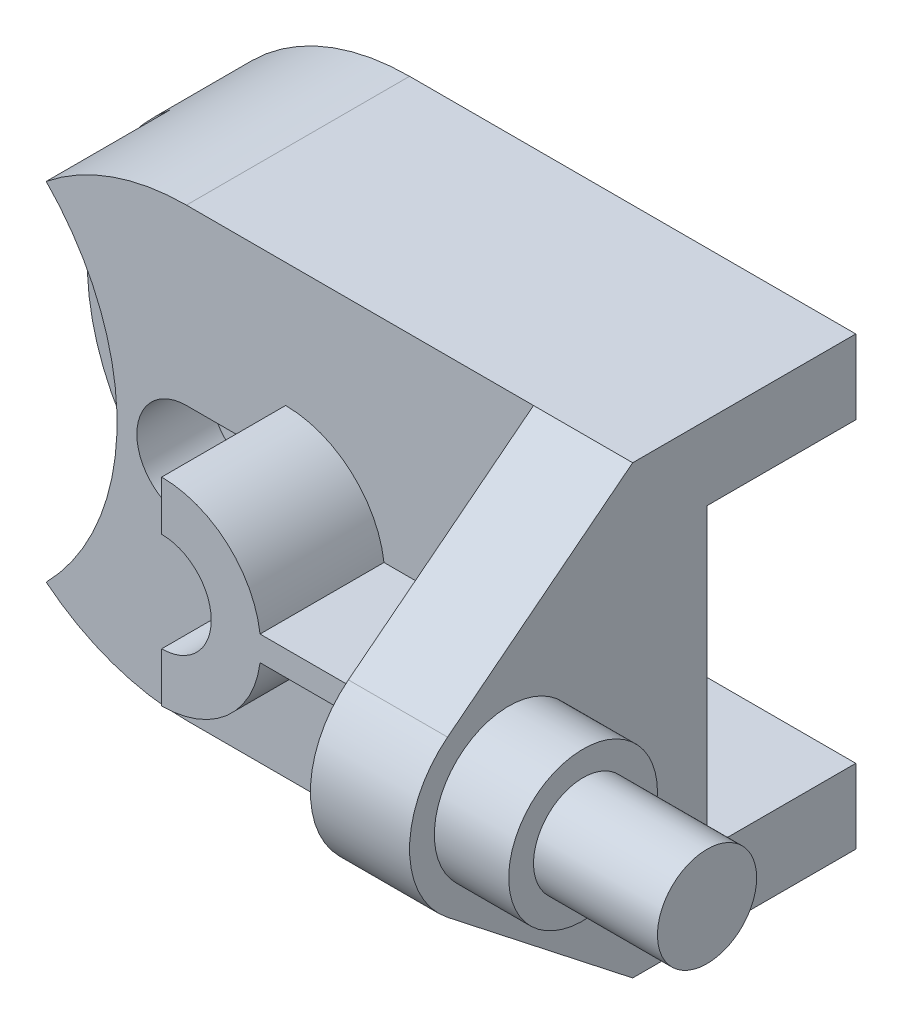
ISO-10303-21;
HEADER;
FILE_DESCRIPTION(('STEP AP214'),'2;1');
FILE_NAME('part.step','',(''),(''),'','','');
FILE_SCHEMA(('AUTOMOTIVE_DESIGN { 1 0 10303 214 1 1 1 1 }'));
ENDSEC;
DATA;
#1=APPLICATION_CONTEXT('core data for automotive mechanical design processes');
#2=APPLICATION_PROTOCOL_DEFINITION('international standard','automotive_design',2000,#1);
#3=PRODUCT_CONTEXT('',#1,'mechanical');
#4=PRODUCT('Part','Part','',(#3));
#5=PRODUCT_RELATED_PRODUCT_CATEGORY('part','',(#4));
#6=PRODUCT_DEFINITION_FORMATION('','',#4);
#7=PRODUCT_DEFINITION_CONTEXT('part definition',#1,'design');
#8=PRODUCT_DEFINITION('design','',#6,#7);
#9=PRODUCT_DEFINITION_SHAPE('','',#8);
#10=(LENGTH_UNIT() NAMED_UNIT(*) SI_UNIT(.MILLI.,.METRE.));
#11=(NAMED_UNIT(*) PLANE_ANGLE_UNIT() SI_UNIT($,.RADIAN.));
#12=(NAMED_UNIT(*) SI_UNIT($,.STERADIAN.) SOLID_ANGLE_UNIT());
#13=UNCERTAINTY_MEASURE_WITH_UNIT(LENGTH_MEASURE(1.E-05),#10,'distance_accuracy_value','');
#14=(GEOMETRIC_REPRESENTATION_CONTEXT(3) GLOBAL_UNCERTAINTY_ASSIGNED_CONTEXT((#13)) GLOBAL_UNIT_ASSIGNED_CONTEXT((#10,
#11,#12)) REPRESENTATION_CONTEXT('',''));
#15=CARTESIAN_POINT('',(0.,0.,0.));
#16=DIRECTION('',(0.,0.,1.));
#17=DIRECTION('',(1.,0.,0.));
#18=AXIS2_PLACEMENT_3D('',#15,#16,#17);
#19=CARTESIAN_POINT('',(-39.0000000000001,90.,45.));
#20=DIRECTION('',(0.,0.,-1.));
#21=DIRECTION('',(0.,1.,0.));
#22=AXIS2_PLACEMENT_3D('',#19,#20,#21);
#23=PLANE('',#22);
#24=DIRECTION('',(1.,0.,0.));
#25=VECTOR('',#24,1.);
#26=CARTESIAN_POINT('',(84.8431348329845,42.5,45.));
#27=LINE('',#26,#25);
#28=CARTESIAN_POINT('',(84.8431348329845,42.5,45.));
#29=VERTEX_POINT('',#28);
#30=CARTESIAN_POINT('',(115.,42.5,45.));
#31=VERTEX_POINT('',#30);
#32=EDGE_CURVE('E570',#29,#31,#27,.T.);
#33=ORIENTED_EDGE('',*,*,#32,.F.);
#34=CARTESIAN_POINT('',(65.,45.,45.));
#35=DIRECTION('',(0.,0.,1.));
#36=DIRECTION('',(-1.,0.,0.));
#37=AXIS2_PLACEMENT_3D('',#34,#35,#36);
#38=CIRCLE('',#37,20.);
#39=CARTESIAN_POINT('',(65.,24.9999999999999,45.));
#40=VERTEX_POINT('',#39);
#41=EDGE_CURVE('E273',#40,#29,#38,.T.);
#42=ORIENTED_EDGE('',*,*,#41,.F.);
#43=DIRECTION('',(0.,-1.,0.));
#44=VECTOR('',#43,1.);
#45=CARTESIAN_POINT('',(65.,35.,45.));
#46=LINE('',#45,#44);
#47=CARTESIAN_POINT('',(65.,35.,45.));
#48=VERTEX_POINT('',#47);
#49=EDGE_CURVE('E288',#48,#40,#46,.T.);
#50=ORIENTED_EDGE('',*,*,#49,.F.);
#51=DIRECTION('',(1.,0.,0.));
#52=VECTOR('',#51,1.);
#53=CARTESIAN_POINT('',(65.,35.,45.));
#54=LINE('',#53,#52);
#55=CARTESIAN_POINT('',(45.,35.,45.));
#56=VERTEX_POINT('',#55);
#57=EDGE_CURVE('E554',#56,#48,#54,.T.);
#58=ORIENTED_EDGE('',*,*,#57,.F.);
#59=CARTESIAN_POINT('',(45.,45.,45.));
#60=DIRECTION('',(0.,0.,1.));
#61=DIRECTION('',(1.,0.,0.));
#62=AXIS2_PLACEMENT_3D('',#59,#60,#61);
#63=CIRCLE('',#62,10.);
#64=CARTESIAN_POINT('',(45.,55.,45.));
#65=VERTEX_POINT('',#64);
#66=EDGE_CURVE('E551',#65,#56,#63,.T.);
#67=ORIENTED_EDGE('',*,*,#66,.F.);
#68=DIRECTION('',(-1.,0.,0.));
#69=VECTOR('',#68,1.);
#70=CARTESIAN_POINT('',(65.,55.,45.));
#71=LINE('',#70,#69);
#72=CARTESIAN_POINT('',(65.,55.,45.));
#73=VERTEX_POINT('',#72);
#74=EDGE_CURVE('E274',#73,#65,#71,.T.);
#75=ORIENTED_EDGE('',*,*,#74,.F.);
#76=DIRECTION('',(0.,-1.,0.));
#77=VECTOR('',#76,1.);
#78=CARTESIAN_POINT('',(65.,55.,45.));
#79=LINE('',#78,#77);
#80=CARTESIAN_POINT('',(65.,65.,45.));
#81=VERTEX_POINT('',#80);
#82=EDGE_CURVE('E294',#81,#73,#79,.T.);
#83=ORIENTED_EDGE('',*,*,#82,.F.);
#84=CARTESIAN_POINT('',(84.8431348329845,47.5,45.));
#85=VERTEX_POINT('',#84);
#86=EDGE_CURVE('E291',#85,#81,#38,.T.);
#87=ORIENTED_EDGE('',*,*,#86,.F.);
#88=DIRECTION('',(-1.,0.,0.));
#89=VECTOR('',#88,1.);
#90=CARTESIAN_POINT('',(84.8431348329845,47.5,45.));
#91=LINE('',#90,#89);
#92=CARTESIAN_POINT('',(115.,47.5,45.));
#93=VERTEX_POINT('',#92);
#94=EDGE_CURVE('E265',#93,#85,#91,.T.);
#95=ORIENTED_EDGE('',*,*,#94,.F.);
#96=DIRECTION('',(0.,1.,0.));
#97=VECTOR('',#96,1.);
#98=CARTESIAN_POINT('',(115.,90.,45.));
#99=LINE('',#98,#97);
#100=CARTESIAN_POINT('',(115.,90.,45.));
#101=VERTEX_POINT('',#100);
#102=EDGE_CURVE('E308',#93,#101,#99,.T.);
#103=ORIENTED_EDGE('',*,*,#102,.T.);
#104=DIRECTION('',(1.,0.,0.));
#105=VECTOR('',#104,1.);
#106=CARTESIAN_POINT('',(-39.0000000000001,90.,45.));
#107=LINE('',#106,#105);
#108=CARTESIAN_POINT('',(45.,90.,45.));
#109=VERTEX_POINT('',#108);
#110=EDGE_CURVE('E312',#109,#101,#107,.T.);
#111=ORIENTED_EDGE('',*,*,#110,.F.);
#112=CARTESIAN_POINT('',(45.,45.,45.));
#113=DIRECTION('',(0.,0.,-1.));
#114=DIRECTION('',(0.,1.,0.));
#115=AXIS2_PLACEMENT_3D('',#112,#113,#114);
#116=CIRCLE('',#115,45.);
#117=CARTESIAN_POINT('',(16.7157287525381,80.,45.));
#118=VERTEX_POINT('',#117);
#119=EDGE_CURVE('E324',#109,#118,#116,.F.);
#120=ORIENTED_EDGE('',*,*,#119,.T.);
#121=CARTESIAN_POINT('',(-18.9914133901762,45.,45.));
#122=DIRECTION('',(0.,0.,-1.));
#123=DIRECTION('',(0.,1.,0.));
#124=AXIS2_PLACEMENT_3D('',#121,#122,#123);
#125=CIRCLE('',#124,50.);
#126=CARTESIAN_POINT('',(16.7157287525381,10.,45.));
#127=VERTEX_POINT('',#126);
#128=EDGE_CURVE('E320',#118,#127,#125,.T.);
#129=ORIENTED_EDGE('',*,*,#128,.T.);
#130=CARTESIAN_POINT('',(45.,0.,45.));
#131=VERTEX_POINT('',#130);
#132=EDGE_CURVE('E322',#127,#131,#116,.F.);
#133=ORIENTED_EDGE('',*,*,#132,.T.);
#134=DIRECTION('',(-1.,0.,0.));
#135=VECTOR('',#134,1.);
#136=CARTESIAN_POINT('',(308.,0.,45.));
#137=LINE('',#136,#135);
#138=CARTESIAN_POINT('',(115.,0.,45.));
#139=VERTEX_POINT('',#138);
#140=EDGE_CURVE('E375',#139,#131,#137,.T.);
#141=ORIENTED_EDGE('',*,*,#140,.F.);
#142=EDGE_CURVE('E309',#139,#31,#99,.T.);
#143=ORIENTED_EDGE('',*,*,#142,.T.);
#144=EDGE_LOOP('',(#33,#42,#50,#58,#67,#75,#83,#87,#95,#103,#111,#120,#129,#133,#141,#143));
#145=FACE_BOUND('',#144,.T.);
#146=ADVANCED_FACE('F81',(#145),#23,.F.);
#147=CARTESIAN_POINT('',(115.,0.,0.));
#148=DIRECTION('',(-1.,0.,0.));
#149=DIRECTION('',(0.,0.,1.));
#150=AXIS2_PLACEMENT_3D('',#147,#148,#149);
#151=PLANE('',#150);
#152=DIRECTION('',(0.,1.,0.));
#153=VECTOR('',#152,1.);
#154=CARTESIAN_POINT('',(115.,47.5,70.));
#155=LINE('',#154,#153);
#156=CARTESIAN_POINT('',(115.,42.5,70.));
#157=VERTEX_POINT('',#156);
#158=CARTESIAN_POINT('',(115.,47.5,70.));
#159=VERTEX_POINT('',#158);
#160=EDGE_CURVE('E264',#157,#159,#155,.T.);
#161=ORIENTED_EDGE('',*,*,#160,.F.);
#162=DIRECTION('',(0.,0.,-1.));
#163=VECTOR('',#162,1.);
#164=CARTESIAN_POINT('',(115.,42.5,70.));
#165=LINE('',#164,#163);
#166=EDGE_CURVE('E260',#157,#31,#165,.T.);
#167=ORIENTED_EDGE('',*,*,#166,.T.);
#168=ORIENTED_EDGE('',*,*,#142,.F.);
#169=DIRECTION('',(0.,0.616806573816474,0.787114763231375));
#170=VECTOR('',#169,1.);
#171=CARTESIAN_POINT('',(115.,-21.8473902139099,17.1202657276448));
#172=LINE('',#171,#170);
#173=CARTESIAN_POINT('',(115.,29.2577047353725,82.3361314763295));
#174=VERTEX_POINT('',#173);
#175=EDGE_CURVE('E12',#139,#174,#172,.T.);
#176=ORIENTED_EDGE('',*,*,#175,.T.);
#177=CARTESIAN_POINT('',(115.,45.,70.));
#178=DIRECTION('',(-1.,0.,0.));
#179=DIRECTION('',(0.,0.,1.));
#180=AXIS2_PLACEMENT_3D('',#177,#178,#179);
#181=CIRCLE('',#180,20.);
#182=CARTESIAN_POINT('',(115.,60.7422952646275,82.3361314763295));
#183=VERTEX_POINT('',#182);
#184=EDGE_CURVE('E315',#174,#183,#181,.T.);
#185=ORIENTED_EDGE('',*,*,#184,.T.);
#186=DIRECTION('',(0.,0.616806573816474,-0.787114763231375));
#187=VECTOR('',#186,1.);
#188=CARTESIAN_POINT('',(115.,77.6068587586204,60.8150461554646));
#189=LINE('',#188,#187);
#190=EDGE_CURVE('E317',#183,#101,#189,.T.);
#191=ORIENTED_EDGE('',*,*,#190,.T.);
#192=ORIENTED_EDGE('',*,*,#102,.F.);
#193=DIRECTION('',(0.,0.,-1.));
#194=VECTOR('',#193,1.);
#195=CARTESIAN_POINT('',(115.,47.5,70.));
#196=LINE('',#195,#194);
#197=EDGE_CURVE('E578',#159,#93,#196,.T.);
#198=ORIENTED_EDGE('',*,*,#197,.F.);
#199=EDGE_LOOP('',(#161,#167,#168,#176,#185,#191,#192,#198));
#200=FACE_BOUND('',#199,.T.);
#201=ADVANCED_FACE('F478',(#200),#151,.T.);
#202=CARTESIAN_POINT('',(65.,45.,70.));
#203=DIRECTION('',(0.,0.,-1.));
#204=DIRECTION('',(-1.,0.,0.));
#205=AXIS2_PLACEMENT_3D('',#202,#203,#204);
#206=CYLINDRICAL_SURFACE('',#205,20.);
#207=DIRECTION('',(0.,0.,-1.));
#208=VECTOR('',#207,1.);
#209=CARTESIAN_POINT('',(84.8431348329845,42.5,70.));
#210=LINE('',#209,#208);
#211=CARTESIAN_POINT('',(84.8431348329845,42.5,70.));
#212=VERTEX_POINT('',#211);
#213=EDGE_CURVE('E257',#212,#29,#210,.T.);
#214=ORIENTED_EDGE('',*,*,#213,.F.);
#215=CARTESIAN_POINT('',(65.,45.,70.));
#216=DIRECTION('',(0.,0.,1.));
#217=DIRECTION('',(-1.,0.,0.));
#218=AXIS2_PLACEMENT_3D('',#215,#216,#217);
#219=CIRCLE('',#218,20.);
#220=CARTESIAN_POINT('',(65.,24.9999999999999,70.));
#221=VERTEX_POINT('',#220);
#222=EDGE_CURVE('E272',#221,#212,#219,.T.);
#223=ORIENTED_EDGE('',*,*,#222,.F.);
#224=DIRECTION('',(0.,0.,-1.));
#225=VECTOR('',#224,1.);
#226=CARTESIAN_POINT('',(65.,24.9999999999999,70.));
#227=LINE('',#226,#225);
#228=EDGE_CURVE('E303',#221,#40,#227,.T.);
#229=ORIENTED_EDGE('',*,*,#228,.T.);
#230=ORIENTED_EDGE('',*,*,#41,.T.);
#231=EDGE_LOOP('',(#214,#223,#229,#230));
#232=FACE_BOUND('',#231,.T.);
#233=ADVANCED_FACE('F270',(#232),#206,.T.);
#234=DIRECTION('',(0.,0.,-1.));
#235=VECTOR('',#234,1.);
#236=CARTESIAN_POINT('',(84.8431348329845,47.5,70.));
#237=LINE('',#236,#235);
#238=CARTESIAN_POINT('',(84.8431348329845,47.5,70.));
#239=VERTEX_POINT('',#238);
#240=EDGE_CURVE('E96',#239,#85,#237,.T.);
#241=ORIENTED_EDGE('',*,*,#240,.T.);
#242=ORIENTED_EDGE('',*,*,#86,.T.);
#243=DIRECTION('',(0.,0.,-1.));
#244=VECTOR('',#243,1.);
#245=CARTESIAN_POINT('',(65.,65.,70.));
#246=LINE('',#245,#244);
#247=CARTESIAN_POINT('',(65.,65.,70.));
#248=VERTEX_POINT('',#247);
#249=EDGE_CURVE('E300',#248,#81,#246,.T.);
#250=ORIENTED_EDGE('',*,*,#249,.F.);
#251=EDGE_CURVE('E281',#239,#248,#219,.T.);
#252=ORIENTED_EDGE('',*,*,#251,.F.);
#253=EDGE_LOOP('',(#241,#242,#250,#252));
#254=FACE_BOUND('',#253,.T.);
#255=ADVANCED_FACE('F593',(#254),#206,.T.);
#256=CARTESIAN_POINT('',(308.,45.,70.));
#257=DIRECTION('',(-1.,0.,0.));
#258=DIRECTION('',(0.,0.,1.));
#259=AXIS2_PLACEMENT_3D('',#256,#257,#258);
#260=CYLINDRICAL_SURFACE('',#259,20.);
#261=ORIENTED_EDGE('',*,*,#184,.F.);
#262=DIRECTION('',(-1.,0.,0.));
#263=VECTOR('',#262,1.);
#264=CARTESIAN_POINT('',(308.,29.2577047353725,82.3361314763295));
#265=LINE('',#264,#263);
#266=CARTESIAN_POINT('',(135.,29.2577047353725,82.3361314763295));
#267=VERTEX_POINT('',#266);
#268=EDGE_CURVE('E370',#267,#174,#265,.T.);
#269=ORIENTED_EDGE('',*,*,#268,.F.);
#270=CARTESIAN_POINT('',(135.,45.,70.));
#271=DIRECTION('',(-1.,0.,0.));
#272=DIRECTION('',(0.,0.,1.));
#273=AXIS2_PLACEMENT_3D('',#270,#271,#272);
#274=CIRCLE('',#273,20.);
#275=CARTESIAN_POINT('',(135.,60.7422952646275,82.3361314763295));
#276=VERTEX_POINT('',#275);
#277=EDGE_CURVE('E389',#276,#267,#274,.F.);
#278=ORIENTED_EDGE('',*,*,#277,.F.);
#279=DIRECTION('',(-1.,0.,0.));
#280=VECTOR('',#279,1.);
#281=CARTESIAN_POINT('',(308.,60.7422952646275,82.3361314763295));
#282=LINE('',#281,#280);
#283=EDGE_CURVE('E383',#276,#183,#282,.T.);
#284=ORIENTED_EDGE('',*,*,#283,.T.);
#285=EDGE_LOOP('',(#261,#269,#278,#284));
#286=FACE_BOUND('',#285,.T.);
#287=ADVANCED_FACE('F471',(#286),#260,.T.);
#288=CARTESIAN_POINT('',(308.,77.6068587586204,60.8150461554646));
#289=DIRECTION('',(0.,-0.787114763231375,-0.616806573816474));
#290=DIRECTION('',(0.,0.616806573816474,-0.787114763231375));
#291=AXIS2_PLACEMENT_3D('',#288,#289,#290);
#292=PLANE('',#291);
#293=ORIENTED_EDGE('',*,*,#190,.F.);
#294=ORIENTED_EDGE('',*,*,#283,.F.);
#295=DIRECTION('',(0.,-0.616806573816474,0.787114763231375));
#296=VECTOR('',#295,1.);
#297=CARTESIAN_POINT('',(135.,111.84739021391,17.1202657276448));
#298=LINE('',#297,#296);
#299=CARTESIAN_POINT('',(135.,90.,45.));
#300=VERTEX_POINT('',#299);
#301=EDGE_CURVE('E386',#300,#276,#298,.T.);
#302=ORIENTED_EDGE('',*,*,#301,.F.);
#303=DIRECTION('',(-1.,0.,0.));
#304=VECTOR('',#303,1.);
#305=CARTESIAN_POINT('',(308.,90.,45.));
#306=LINE('',#305,#304);
#307=EDGE_CURVE('E380',#300,#101,#306,.T.);
#308=ORIENTED_EDGE('',*,*,#307,.T.);
#309=EDGE_LOOP('',(#293,#294,#302,#308));
#310=FACE_BOUND('',#309,.T.);
#311=ADVANCED_FACE('F474',(#310),#292,.F.);
#312=CARTESIAN_POINT('',(308.,-21.8473902139099,17.1202657276448));
#313=DIRECTION('',(0.,0.787114763231375,-0.616806573816474));
#314=DIRECTION('',(0.,0.616806573816474,0.787114763231375));
#315=AXIS2_PLACEMENT_3D('',#312,#313,#314);
#316=PLANE('',#315);
#317=ORIENTED_EDGE('',*,*,#175,.F.);
#318=CARTESIAN_POINT('',(135.,0.,45.));
#319=VERTEX_POINT('',#318);
#320=EDGE_CURVE('E371',#319,#139,#137,.T.);
#321=ORIENTED_EDGE('',*,*,#320,.F.);
#322=DIRECTION('',(0.,-0.616806573816474,-0.787114763231375));
#323=VECTOR('',#322,1.);
#324=CARTESIAN_POINT('',(135.,-21.8473902139099,17.1202657276448));
#325=LINE('',#324,#323);
#326=EDGE_CURVE('E374',#267,#319,#325,.T.);
#327=ORIENTED_EDGE('',*,*,#326,.F.);
#328=ORIENTED_EDGE('',*,*,#268,.T.);
#329=EDGE_LOOP('',(#317,#321,#327,#328));
#330=FACE_BOUND('',#329,.T.);
#331=ADVANCED_FACE('F464',(#330),#316,.F.);
#332=CARTESIAN_POINT('',(150.,60.,0.));
#333=DIRECTION('',(-1.,0.,0.));
#334=DIRECTION('',(0.,0.,1.));
#335=AXIS2_PLACEMENT_3D('',#332,#333,#334);
#336=PLANE('',#335);
#337=CARTESIAN_POINT('',(150.,45.,70.));
#338=DIRECTION('',(1.,0.,0.));
#339=DIRECTION('',(0.,0.,-1.));
#340=AXIS2_PLACEMENT_3D('',#337,#338,#339);
#341=CIRCLE('',#340,10.);
#342=CARTESIAN_POINT('',(150.,45.,60.));
#343=VERTEX_POINT('',#342);
#344=EDGE_CURVE('E332',#343,#343,#341,.T.);
#345=ORIENTED_EDGE('',*,*,#344,.F.);
#346=EDGE_LOOP('',(#345));
#347=FACE_BOUND('',#346,.T.);
#348=CARTESIAN_POINT('',(150.,45.,70.));
#349=DIRECTION('',(1.,0.,0.));
#350=DIRECTION('',(0.,0.,-1.));
#351=AXIS2_PLACEMENT_3D('',#348,#349,#350);
#352=CIRCLE('',#351,15.);
#353=CARTESIAN_POINT('',(150.,45.,55.));
#354=VERTEX_POINT('',#353);
#355=EDGE_CURVE('E329',#354,#354,#352,.T.);
#356=ORIENTED_EDGE('',*,*,#355,.T.);
#357=EDGE_LOOP('',(#356));
#358=FACE_BOUND('',#357,.T.);
#359=ADVANCED_FACE('F719',(#347,#358),#336,.F.);
#360=CARTESIAN_POINT('',(175.,0.,90.));
#361=DIRECTION('',(-1.,0.,0.));
#362=DIRECTION('',(0.,0.,1.));
#363=AXIS2_PLACEMENT_3D('',#360,#361,#362);
#364=PLANE('',#363);
#365=CARTESIAN_POINT('',(175.,45.,70.));
#366=DIRECTION('',(1.,0.,0.));
#367=DIRECTION('',(0.,0.,-1.));
#368=AXIS2_PLACEMENT_3D('',#365,#366,#367);
#369=CIRCLE('',#368,10.);
#370=CARTESIAN_POINT('',(175.,45.,60.));
#371=VERTEX_POINT('',#370);
#372=EDGE_CURVE('E328',#371,#371,#369,.T.);
#373=ORIENTED_EDGE('',*,*,#372,.T.);
#374=EDGE_LOOP('',(#373));
#375=FACE_BOUND('',#374,.T.);
#376=ADVANCED_FACE('F727',(#375),#364,.F.);
#377=CARTESIAN_POINT('',(45.,45.,0.));
#378=DIRECTION('',(0.,0.,1.));
#379=DIRECTION('',(1.,0.,0.));
#380=AXIS2_PLACEMENT_3D('',#377,#378,#379);
#381=CYLINDRICAL_SURFACE('',#380,45.);
#382=ORIENTED_EDGE('',*,*,#119,.F.);
#383=DIRECTION('',(0.,0.,1.));
#384=VECTOR('',#383,1.);
#385=CARTESIAN_POINT('',(45.,90.,0.));
#386=LINE('',#385,#384);
#387=CARTESIAN_POINT('',(45.,90.,0.));
#388=VERTEX_POINT('',#387);
#389=EDGE_CURVE('E420',#388,#109,#386,.T.);
#390=ORIENTED_EDGE('',*,*,#389,.F.);
#391=CARTESIAN_POINT('',(45.,45.,0.));
#392=DIRECTION('',(0.,0.,1.));
#393=DIRECTION('',(1.,0.,0.));
#394=AXIS2_PLACEMENT_3D('',#391,#392,#393);
#395=CIRCLE('',#394,45.);
#396=CARTESIAN_POINT('',(45.,0.,0.));
#397=VERTEX_POINT('',#396);
#398=EDGE_CURVE('E418',#388,#397,#395,.T.);
#399=ORIENTED_EDGE('',*,*,#398,.T.);
#400=DIRECTION('',(0.,0.,1.));
#401=VECTOR('',#400,1.);
#402=CARTESIAN_POINT('',(45.,0.,0.));
#403=LINE('',#402,#401);
#404=EDGE_CURVE('E415',#397,#131,#403,.T.);
#405=ORIENTED_EDGE('',*,*,#404,.T.);
#406=ORIENTED_EDGE('',*,*,#132,.F.);
#407=DIRECTION('',(0.,0.,1.));
#408=VECTOR('',#407,1.);
#409=CARTESIAN_POINT('',(16.7157287525381,10.,20.));
#410=LINE('',#409,#408);
#411=CARTESIAN_POINT('',(16.7157287525381,10.,20.));
#412=VERTEX_POINT('',#411);
#413=EDGE_CURVE('E399',#412,#127,#410,.T.);
#414=ORIENTED_EDGE('',*,*,#413,.F.);
#415=CARTESIAN_POINT('',(45.,45.,20.));
#416=DIRECTION('',(0.,0.,1.));
#417=DIRECTION('',(1.,0.,0.));
#418=AXIS2_PLACEMENT_3D('',#415,#416,#417);
#419=CIRCLE('',#418,45.);
#420=CARTESIAN_POINT('',(16.7157287525381,80.,20.));
#421=VERTEX_POINT('',#420);
#422=EDGE_CURVE('E395',#421,#412,#419,.T.);
#423=ORIENTED_EDGE('',*,*,#422,.F.);
#424=DIRECTION('',(0.,0.,1.));
#425=VECTOR('',#424,1.);
#426=CARTESIAN_POINT('',(16.7157287525381,80.,20.));
#427=LINE('',#426,#425);
#428=EDGE_CURVE('E398',#421,#118,#427,.T.);
#429=ORIENTED_EDGE('',*,*,#428,.T.);
#430=EDGE_LOOP('',(#382,#390,#399,#405,#406,#414,#423,#429));
#431=FACE_BOUND('',#430,.T.);
#432=ADVANCED_FACE('F453',(#431),#381,.T.);
#433=CARTESIAN_POINT('',(0.,0.,0.));
#434=DIRECTION('',(0.,0.,-1.));
#435=DIRECTION('',(-1.,0.,0.));
#436=AXIS2_PLACEMENT_3D('',#433,#434,#435);
#437=PLANE('',#436);
#438=DIRECTION('',(1.,0.,0.));
#439=VECTOR('',#438,1.);
#440=CARTESIAN_POINT('',(135.,75.,0.));
#441=LINE('',#440,#439);
#442=CARTESIAN_POINT('',(45.,75.,0.));
#443=VERTEX_POINT('',#442);
#444=CARTESIAN_POINT('',(135.,75.,0.));
#445=VERTEX_POINT('',#444);
#446=EDGE_CURVE('E341',#443,#445,#441,.T.);
#447=ORIENTED_EDGE('',*,*,#446,.F.);
#448=CARTESIAN_POINT('',(45.,45.,0.));
#449=DIRECTION('',(0.,0.,-1.));
#450=DIRECTION('',(1.,0.,0.));
#451=AXIS2_PLACEMENT_3D('',#448,#449,#450);
#452=CIRCLE('',#451,30.);
#453=CARTESIAN_POINT('',(45.,15.,0.));
#454=VERTEX_POINT('',#453);
#455=EDGE_CURVE('E354',#454,#443,#452,.T.);
#456=ORIENTED_EDGE('',*,*,#455,.F.);
#457=DIRECTION('',(-1.,0.,0.));
#458=VECTOR('',#457,1.);
#459=CARTESIAN_POINT('',(135.,15.,0.));
#460=LINE('',#459,#458);
#461=CARTESIAN_POINT('',(135.,15.,0.));
#462=VERTEX_POINT('',#461);
#463=EDGE_CURVE('E335',#462,#454,#460,.T.);
#464=ORIENTED_EDGE('',*,*,#463,.F.);
#465=DIRECTION('',(0.,-1.,0.));
#466=VECTOR('',#465,1.);
#467=CARTESIAN_POINT('',(135.,0.,0.));
#468=LINE('',#467,#466);
#469=CARTESIAN_POINT('',(135.,0.,0.));
#470=VERTEX_POINT('',#469);
#471=EDGE_CURVE('E402',#462,#470,#468,.T.);
#472=ORIENTED_EDGE('',*,*,#471,.T.);
#473=DIRECTION('',(1.,0.,0.));
#474=VECTOR('',#473,1.);
#475=CARTESIAN_POINT('',(0.,0.,0.));
#476=LINE('',#475,#474);
#477=EDGE_CURVE('E423',#397,#470,#476,.T.);
#478=ORIENTED_EDGE('',*,*,#477,.F.);
#479=ORIENTED_EDGE('',*,*,#398,.F.);
#480=DIRECTION('',(-1.,0.,0.));
#481=VECTOR('',#480,1.);
#482=CARTESIAN_POINT('',(0.,90.,0.));
#483=LINE('',#482,#481);
#484=CARTESIAN_POINT('',(135.,90.,0.));
#485=VERTEX_POINT('',#484);
#486=EDGE_CURVE('E426',#485,#388,#483,.T.);
#487=ORIENTED_EDGE('',*,*,#486,.F.);
#488=DIRECTION('',(0.,-1.,0.));
#489=VECTOR('',#488,1.);
#490=CARTESIAN_POINT('',(135.,90.,0.));
#491=LINE('',#490,#489);
#492=EDGE_CURVE('E409',#485,#445,#491,.T.);
#493=ORIENTED_EDGE('',*,*,#492,.T.);
#494=EDGE_LOOP('',(#447,#456,#464,#472,#478,#479,#487,#493));
#495=FACE_BOUND('',#494,.T.);
#496=ADVANCED_FACE('F489',(#495),#437,.T.);
#497=CARTESIAN_POINT('',(0.,0.,90.));
#498=DIRECTION('',(0.,1.,0.));
#499=DIRECTION('',(0.,0.,1.));
#500=AXIS2_PLACEMENT_3D('',#497,#498,#499);
#501=PLANE('',#500);
#502=DIRECTION('',(0.,0.,1.));
#503=VECTOR('',#502,1.);
#504=CARTESIAN_POINT('',(135.,0.,0.));
#505=LINE('',#504,#503);
#506=EDGE_CURVE('E406',#470,#319,#505,.T.);
#507=ORIENTED_EDGE('',*,*,#506,.T.);
#508=ORIENTED_EDGE('',*,*,#320,.T.);
#509=ORIENTED_EDGE('',*,*,#140,.T.);
#510=ORIENTED_EDGE('',*,*,#404,.F.);
#511=ORIENTED_EDGE('',*,*,#477,.T.);
#512=EDGE_LOOP('',(#507,#508,#509,#510,#511));
#513=FACE_BOUND('',#512,.T.);
#514=ADVANCED_FACE('F83',(#513),#501,.F.);
#515=CARTESIAN_POINT('',(0.,90.,90.));
#516=DIRECTION('',(0.,-1.,0.));
#517=DIRECTION('',(0.,0.,-1.));
#518=AXIS2_PLACEMENT_3D('',#515,#516,#517);
#519=PLANE('',#518);
#520=ORIENTED_EDGE('',*,*,#389,.T.);
#521=ORIENTED_EDGE('',*,*,#110,.T.);
#522=ORIENTED_EDGE('',*,*,#307,.F.);
#523=DIRECTION('',(0.,0.,1.));
#524=VECTOR('',#523,1.);
#525=CARTESIAN_POINT('',(135.,90.,0.));
#526=LINE('',#525,#524);
#527=EDGE_CURVE('E412',#485,#300,#526,.T.);
#528=ORIENTED_EDGE('',*,*,#527,.F.);
#529=ORIENTED_EDGE('',*,*,#486,.T.);
#530=EDGE_LOOP('',(#520,#521,#522,#528,#529));
#531=FACE_BOUND('',#530,.T.);
#532=ADVANCED_FACE('F481',(#531),#519,.F.);
#533=CARTESIAN_POINT('',(135.,90.,0.));
#534=DIRECTION('',(-1.,0.,0.));
#535=DIRECTION('',(0.,0.,1.));
#536=AXIS2_PLACEMENT_3D('',#533,#534,#535);
#537=PLANE('',#536);
#538=CARTESIAN_POINT('',(135.,45.,70.));
#539=DIRECTION('',(1.,0.,0.));
#540=DIRECTION('',(0.,0.,-1.));
#541=AXIS2_PLACEMENT_3D('',#538,#539,#540);
#542=CIRCLE('',#541,15.);
#543=CARTESIAN_POINT('',(135.,45.,55.));
#544=VERTEX_POINT('',#543);
#545=EDGE_CURVE('E325',#544,#544,#542,.T.);
#546=ORIENTED_EDGE('',*,*,#545,.F.);
#547=EDGE_LOOP('',(#546));
#548=FACE_BOUND('',#547,.T.);
#549=DIRECTION('',(0.,-1.,0.));
#550=VECTOR('',#549,1.);
#551=CARTESIAN_POINT('',(135.,75.,30.));
#552=LINE('',#551,#550);
#553=CARTESIAN_POINT('',(135.,75.,30.));
#554=VERTEX_POINT('',#553);
#555=CARTESIAN_POINT('',(135.,15.,30.));
#556=VERTEX_POINT('',#555);
#557=EDGE_CURVE('E338',#554,#556,#552,.T.);
#558=ORIENTED_EDGE('',*,*,#557,.F.);
#559=DIRECTION('',(0.,0.,-1.));
#560=VECTOR('',#559,1.);
#561=CARTESIAN_POINT('',(135.,75.,30.));
#562=LINE('',#561,#560);
#563=EDGE_CURVE('E358',#554,#445,#562,.T.);
#564=ORIENTED_EDGE('',*,*,#563,.T.);
#565=ORIENTED_EDGE('',*,*,#492,.F.);
#566=ORIENTED_EDGE('',*,*,#527,.T.);
#567=ORIENTED_EDGE('',*,*,#301,.T.);
#568=ORIENTED_EDGE('',*,*,#277,.T.);
#569=ORIENTED_EDGE('',*,*,#326,.T.);
#570=ORIENTED_EDGE('',*,*,#506,.F.);
#571=ORIENTED_EDGE('',*,*,#471,.F.);
#572=DIRECTION('',(0.,0.,-1.));
#573=VECTOR('',#572,1.);
#574=CARTESIAN_POINT('',(135.,15.,30.));
#575=LINE('',#574,#573);
#576=EDGE_CURVE('E351',#556,#462,#575,.T.);
#577=ORIENTED_EDGE('',*,*,#576,.F.);
#578=EDGE_LOOP('',(#558,#564,#565,#566,#567,#568,#569,#570,#571,#577));
#579=FACE_BOUND('',#578,.T.);
#580=ADVANCED_FACE('F467',(#548,#579),#537,.F.);
#581=CARTESIAN_POINT('',(-18.9914133901762,45.,20.));
#582=DIRECTION('',(0.,0.,1.));
#583=DIRECTION('',(1.,0.,0.));
#584=AXIS2_PLACEMENT_3D('',#581,#582,#583);
#585=CYLINDRICAL_SURFACE('',#584,50.);
#586=ORIENTED_EDGE('',*,*,#128,.F.);
#587=ORIENTED_EDGE('',*,*,#428,.F.);
#588=CARTESIAN_POINT('',(-18.9914133901762,45.,20.));
#589=DIRECTION('',(0.,0.,1.));
#590=DIRECTION('',(1.,0.,0.));
#591=AXIS2_PLACEMENT_3D('',#588,#589,#590);
#592=CIRCLE('',#591,50.);
#593=CARTESIAN_POINT('',(25.505970602179,67.803131755022,20.));
#594=VERTEX_POINT('',#593);
#595=EDGE_CURVE('E392',#421,#594,#592,.F.);
#596=ORIENTED_EDGE('',*,*,#595,.T.);
#597=DIRECTION('',(0.,0.,-1.));
#598=VECTOR('',#597,1.);
#599=CARTESIAN_POINT('',(25.505970602179,67.803131755022,15.));
#600=LINE('',#599,#598);
#601=CARTESIAN_POINT('',(25.505970602179,67.803131755022,30.));
#602=VERTEX_POINT('',#601);
#603=EDGE_CURVE('E368',#602,#594,#600,.T.);
#604=ORIENTED_EDGE('',*,*,#603,.F.);
#605=CARTESIAN_POINT('',(-18.9914133901762,45.,30.));
#606=DIRECTION('',(0.,0.,1.));
#607=DIRECTION('',(1.,0.,0.));
#608=AXIS2_PLACEMENT_3D('',#605,#606,#607);
#609=CIRCLE('',#608,50.);
#610=CARTESIAN_POINT('',(25.505970602179,22.196868244978,30.));
#611=VERTEX_POINT('',#610);
#612=EDGE_CURVE('E89',#611,#602,#609,.T.);
#613=ORIENTED_EDGE('',*,*,#612,.F.);
#614=DIRECTION('',(0.,0.,-1.));
#615=VECTOR('',#614,1.);
#616=CARTESIAN_POINT('',(25.505970602179,22.196868244978,15.));
#617=LINE('',#616,#615);
#618=CARTESIAN_POINT('',(25.505970602179,22.196868244978,20.));
#619=VERTEX_POINT('',#618);
#620=EDGE_CURVE('E361',#619,#611,#617,.F.);
#621=ORIENTED_EDGE('',*,*,#620,.F.);
#622=EDGE_CURVE('E391',#619,#412,#592,.F.);
#623=ORIENTED_EDGE('',*,*,#622,.T.);
#624=ORIENTED_EDGE('',*,*,#413,.T.);
#625=EDGE_LOOP('',(#586,#587,#596,#604,#613,#621,#623,#624));
#626=FACE_BOUND('',#625,.T.);
#627=ADVANCED_FACE('F443',(#626),#585,.F.);
#628=CARTESIAN_POINT('',(0.,0.,20.));
#629=DIRECTION('',(0.,0.,1.));
#630=DIRECTION('',(1.,0.,0.));
#631=AXIS2_PLACEMENT_3D('',#628,#629,#630);
#632=PLANE('',#631);
#633=CARTESIAN_POINT('',(45.,45.,20.));
#634=DIRECTION('',(0.,0.,1.));
#635=DIRECTION('',(1.,0.,0.));
#636=AXIS2_PLACEMENT_3D('',#633,#634,#635);
#637=CIRCLE('',#636,30.);
#638=EDGE_CURVE('E428',#594,#619,#637,.T.);
#639=ORIENTED_EDGE('',*,*,#638,.F.);
#640=ORIENTED_EDGE('',*,*,#595,.F.);
#641=ORIENTED_EDGE('',*,*,#422,.T.);
#642=ORIENTED_EDGE('',*,*,#622,.F.);
#643=EDGE_LOOP('',(#639,#640,#641,#642));
#644=FACE_BOUND('',#643,.T.);
#645=ADVANCED_FACE('F447',(#644),#632,.T.);
#646=CARTESIAN_POINT('',(135.,75.,30.));
#647=DIRECTION('',(0.,1.,0.));
#648=DIRECTION('',(0.,0.,1.));
#649=AXIS2_PLACEMENT_3D('',#646,#647,#648);
#650=PLANE('',#649);
#651=ORIENTED_EDGE('',*,*,#446,.T.);
#652=ORIENTED_EDGE('',*,*,#563,.F.);
#653=DIRECTION('',(1.,0.,0.));
#654=VECTOR('',#653,1.);
#655=CARTESIAN_POINT('',(135.,75.,30.));
#656=LINE('',#655,#654);
#657=CARTESIAN_POINT('',(45.,75.,30.));
#658=VERTEX_POINT('',#657);
#659=EDGE_CURVE('E348',#658,#554,#656,.T.);
#660=ORIENTED_EDGE('',*,*,#659,.F.);
#661=DIRECTION('',(0.,0.,-1.));
#662=VECTOR('',#661,1.);
#663=CARTESIAN_POINT('',(45.,75.,30.));
#664=LINE('',#663,#662);
#665=EDGE_CURVE('E362',#658,#443,#664,.T.);
#666=ORIENTED_EDGE('',*,*,#665,.T.);
#667=EDGE_LOOP('',(#651,#652,#660,#666));
#668=FACE_BOUND('',#667,.T.);
#669=ADVANCED_FACE('F498',(#668),#650,.F.);
#670=CARTESIAN_POINT('',(45.,45.,30.));
#671=DIRECTION('',(0.,0.,-1.));
#672=DIRECTION('',(-1.,0.,0.));
#673=AXIS2_PLACEMENT_3D('',#670,#671,#672);
#674=CYLINDRICAL_SURFACE('',#673,30.);
#675=ORIENTED_EDGE('',*,*,#603,.T.);
#676=ORIENTED_EDGE('',*,*,#638,.T.);
#677=ORIENTED_EDGE('',*,*,#620,.T.);
#678=CARTESIAN_POINT('',(45.,45.,30.));
#679=DIRECTION('',(0.,0.,-1.));
#680=DIRECTION('',(1.,0.,0.));
#681=AXIS2_PLACEMENT_3D('',#678,#679,#680);
#682=CIRCLE('',#681,30.);
#683=CARTESIAN_POINT('',(45.,15.,30.));
#684=VERTEX_POINT('',#683);
#685=EDGE_CURVE('E345',#684,#611,#682,.T.);
#686=ORIENTED_EDGE('',*,*,#685,.F.);
#687=DIRECTION('',(0.,0.,-1.));
#688=VECTOR('',#687,1.);
#689=CARTESIAN_POINT('',(45.,15.,30.));
#690=LINE('',#689,#688);
#691=EDGE_CURVE('E364',#684,#454,#690,.T.);
#692=ORIENTED_EDGE('',*,*,#691,.T.);
#693=ORIENTED_EDGE('',*,*,#455,.T.);
#694=ORIENTED_EDGE('',*,*,#665,.F.);
#695=EDGE_CURVE('E344',#602,#658,#682,.T.);
#696=ORIENTED_EDGE('',*,*,#695,.F.);
#697=EDGE_LOOP('',(#675,#676,#677,#686,#692,#693,#694,#696));
#698=FACE_BOUND('',#697,.T.);
#699=ADVANCED_FACE('F439',(#698),#674,.F.);
#700=CARTESIAN_POINT('',(135.,15.,30.));
#701=DIRECTION('',(0.,-1.,0.));
#702=DIRECTION('',(0.,0.,-1.));
#703=AXIS2_PLACEMENT_3D('',#700,#701,#702);
#704=PLANE('',#703);
#705=ORIENTED_EDGE('',*,*,#463,.T.);
#706=ORIENTED_EDGE('',*,*,#691,.F.);
#707=DIRECTION('',(-1.,0.,0.));
#708=VECTOR('',#707,1.);
#709=CARTESIAN_POINT('',(135.,15.,30.));
#710=LINE('',#709,#708);
#711=EDGE_CURVE('E340',#556,#684,#710,.T.);
#712=ORIENTED_EDGE('',*,*,#711,.F.);
#713=ORIENTED_EDGE('',*,*,#576,.T.);
#714=EDGE_LOOP('',(#705,#706,#712,#713));
#715=FACE_BOUND('',#714,.T.);
#716=ADVANCED_FACE('F496',(#715),#704,.F.);
#717=CARTESIAN_POINT('',(45.,45.,30.));
#718=DIRECTION('',(0.,0.,1.));
#719=DIRECTION('',(1.,0.,0.));
#720=AXIS2_PLACEMENT_3D('',#717,#718,#719);
#721=PLANE('',#720);
#722=DIRECTION('',(1.,0.,0.));
#723=VECTOR('',#722,1.);
#724=CARTESIAN_POINT('',(65.,35.,30.));
#725=LINE('',#724,#723);
#726=CARTESIAN_POINT('',(45.,35.,30.));
#727=VERTEX_POINT('',#726);
#728=CARTESIAN_POINT('',(65.,35.,30.));
#729=VERTEX_POINT('',#728);
#730=EDGE_CURVE('E536',#727,#729,#725,.T.);
#731=ORIENTED_EDGE('',*,*,#730,.T.);
#732=CARTESIAN_POINT('',(65.,45.,30.));
#733=DIRECTION('',(0.,0.,1.));
#734=DIRECTION('',(1.,0.,0.));
#735=AXIS2_PLACEMENT_3D('',#732,#733,#734);
#736=CIRCLE('',#735,10.);
#737=CARTESIAN_POINT('',(65.,55.,30.));
#738=VERTEX_POINT('',#737);
#739=EDGE_CURVE('E539',#729,#738,#736,.T.);
#740=ORIENTED_EDGE('',*,*,#739,.T.);
#741=DIRECTION('',(-1.,0.,0.));
#742=VECTOR('',#741,1.);
#743=CARTESIAN_POINT('',(65.,55.,30.));
#744=LINE('',#743,#742);
#745=CARTESIAN_POINT('',(45.,55.,30.));
#746=VERTEX_POINT('',#745);
#747=EDGE_CURVE('E545',#738,#746,#744,.T.);
#748=ORIENTED_EDGE('',*,*,#747,.T.);
#749=CARTESIAN_POINT('',(45.,45.,30.));
#750=DIRECTION('',(0.,0.,1.));
#751=DIRECTION('',(1.,0.,0.));
#752=AXIS2_PLACEMENT_3D('',#749,#750,#751);
#753=CIRCLE('',#752,10.);
#754=EDGE_CURVE('E104',#746,#727,#753,.T.);
#755=ORIENTED_EDGE('',*,*,#754,.T.);
#756=EDGE_LOOP('',(#731,#740,#748,#755));
#757=FACE_BOUND('',#756,.T.);
#758=ORIENTED_EDGE('',*,*,#612,.T.);
#759=ORIENTED_EDGE('',*,*,#695,.T.);
#760=ORIENTED_EDGE('',*,*,#659,.T.);
#761=ORIENTED_EDGE('',*,*,#557,.T.);
#762=ORIENTED_EDGE('',*,*,#711,.T.);
#763=ORIENTED_EDGE('',*,*,#685,.T.);
#764=EDGE_LOOP('',(#758,#759,#760,#761,#762,#763));
#765=FACE_BOUND('',#764,.T.);
#766=ADVANCED_FACE('F432',(#757,#765),#721,.F.);
#767=CARTESIAN_POINT('',(150.,45.,70.));
#768=DIRECTION('',(1.,0.,0.));
#769=DIRECTION('',(0.,0.,-1.));
#770=AXIS2_PLACEMENT_3D('',#767,#768,#769);
#771=CYLINDRICAL_SURFACE('',#770,10.);
#772=ORIENTED_EDGE('',*,*,#372,.F.);
#773=EDGE_LOOP('',(#772));
#774=FACE_BOUND('',#773,.T.);
#775=ORIENTED_EDGE('',*,*,#344,.T.);
#776=EDGE_LOOP('',(#775));
#777=FACE_BOUND('',#776,.T.);
#778=ADVANCED_FACE('F521',(#774,#777),#771,.T.);
#779=CARTESIAN_POINT('',(135.,45.,70.));
#780=DIRECTION('',(1.,0.,0.));
#781=DIRECTION('',(0.,0.,-1.));
#782=AXIS2_PLACEMENT_3D('',#779,#780,#781);
#783=CYLINDRICAL_SURFACE('',#782,15.);
#784=ORIENTED_EDGE('',*,*,#355,.F.);
#785=EDGE_LOOP('',(#784));
#786=FACE_BOUND('',#785,.T.);
#787=ORIENTED_EDGE('',*,*,#545,.T.);
#788=EDGE_LOOP('',(#787));
#789=FACE_BOUND('',#788,.T.);
#790=ADVANCED_FACE('F517',(#786,#789),#783,.T.);
#791=CARTESIAN_POINT('',(65.,45.,70.));
#792=DIRECTION('',(0.,0.,-1.));
#793=DIRECTION('',(-1.,0.,0.));
#794=AXIS2_PLACEMENT_3D('',#791,#792,#793);
#795=CYLINDRICAL_SURFACE('',#794,9.99999999999999);
#796=DIRECTION('',(0.,0.,-1.));
#797=VECTOR('',#796,1.);
#798=CARTESIAN_POINT('',(65.,55.,70.));
#799=LINE('',#798,#797);
#800=CARTESIAN_POINT('',(65.,55.,70.));
#801=VERTEX_POINT('',#800);
#802=EDGE_CURVE('E283',#801,#73,#799,.T.);
#803=ORIENTED_EDGE('',*,*,#802,.T.);
#804=DIRECTION('',(0.,0.,1.));
#805=VECTOR('',#804,1.);
#806=CARTESIAN_POINT('',(65.,55.,30.));
#807=LINE('',#806,#805);
#808=EDGE_CURVE('E541',#738,#73,#807,.T.);
#809=ORIENTED_EDGE('',*,*,#808,.F.);
#810=ORIENTED_EDGE('',*,*,#739,.F.);
#811=DIRECTION('',(0.,0.,1.));
#812=VECTOR('',#811,1.);
#813=CARTESIAN_POINT('',(65.,35.,30.));
#814=LINE('',#813,#812);
#815=EDGE_CURVE('E292',#729,#48,#814,.T.);
#816=ORIENTED_EDGE('',*,*,#815,.T.);
#817=DIRECTION('',(0.,0.,-1.));
#818=VECTOR('',#817,1.);
#819=CARTESIAN_POINT('',(65.,35.,70.));
#820=LINE('',#819,#818);
#821=CARTESIAN_POINT('',(65.,35.,70.));
#822=VERTEX_POINT('',#821);
#823=EDGE_CURVE('E305',#822,#48,#820,.T.);
#824=ORIENTED_EDGE('',*,*,#823,.F.);
#825=CARTESIAN_POINT('',(65.,45.,70.));
#826=DIRECTION('',(0.,0.,-1.));
#827=DIRECTION('',(-1.,0.,0.));
#828=AXIS2_PLACEMENT_3D('',#825,#826,#827);
#829=CIRCLE('',#828,9.99999999999999);
#830=EDGE_CURVE('E297',#801,#822,#829,.T.);
#831=ORIENTED_EDGE('',*,*,#830,.F.);
#832=EDGE_LOOP('',(#803,#809,#810,#816,#824,#831));
#833=FACE_BOUND('',#832,.T.);
#834=ADVANCED_FACE('F520',(#833),#795,.F.);
#835=CARTESIAN_POINT('',(65.,35.,70.));
#836=DIRECTION('',(1.,0.,0.));
#837=DIRECTION('',(0.,1.,0.));
#838=AXIS2_PLACEMENT_3D('',#835,#836,#837);
#839=PLANE('',#838);
#840=ORIENTED_EDGE('',*,*,#49,.T.);
#841=ORIENTED_EDGE('',*,*,#228,.F.);
#842=DIRECTION('',(0.,-1.,0.));
#843=VECTOR('',#842,1.);
#844=CARTESIAN_POINT('',(65.,35.,70.));
#845=LINE('',#844,#843);
#846=EDGE_CURVE('E278',#822,#221,#845,.T.);
#847=ORIENTED_EDGE('',*,*,#846,.F.);
#848=ORIENTED_EDGE('',*,*,#823,.T.);
#849=EDGE_LOOP('',(#840,#841,#847,#848));
#850=FACE_BOUND('',#849,.T.);
#851=ADVANCED_FACE('F567',(#850),#839,.F.);
#852=CARTESIAN_POINT('',(65.,55.,70.));
#853=DIRECTION('',(1.,0.,0.));
#854=DIRECTION('',(0.,0.,-1.));
#855=AXIS2_PLACEMENT_3D('',#852,#853,#854);
#856=PLANE('',#855);
#857=ORIENTED_EDGE('',*,*,#82,.T.);
#858=ORIENTED_EDGE('',*,*,#802,.F.);
#859=DIRECTION('',(0.,-1.,0.));
#860=VECTOR('',#859,1.);
#861=CARTESIAN_POINT('',(65.,55.,70.));
#862=LINE('',#861,#860);
#863=EDGE_CURVE('E280',#248,#801,#862,.T.);
#864=ORIENTED_EDGE('',*,*,#863,.F.);
#865=ORIENTED_EDGE('',*,*,#249,.T.);
#866=EDGE_LOOP('',(#857,#858,#864,#865));
#867=FACE_BOUND('',#866,.T.);
#868=ADVANCED_FACE('F589',(#867),#856,.F.);
#869=CARTESIAN_POINT('',(65.,45.,70.));
#870=DIRECTION('',(0.,0.,-1.));
#871=DIRECTION('',(-1.,0.,0.));
#872=AXIS2_PLACEMENT_3D('',#869,#870,#871);
#873=PLANE('',#872);
#874=ORIENTED_EDGE('',*,*,#222,.T.);
#875=DIRECTION('',(1.,0.,0.));
#876=VECTOR('',#875,1.);
#877=CARTESIAN_POINT('',(84.8431348329845,42.5,70.));
#878=LINE('',#877,#876);
#879=EDGE_CURVE('E254',#212,#157,#878,.T.);
#880=ORIENTED_EDGE('',*,*,#879,.T.);
#881=ORIENTED_EDGE('',*,*,#160,.T.);
#882=DIRECTION('',(-1.,0.,0.));
#883=VECTOR('',#882,1.);
#884=CARTESIAN_POINT('',(84.8431348329845,47.5,70.));
#885=LINE('',#884,#883);
#886=EDGE_CURVE('E574',#159,#239,#885,.T.);
#887=ORIENTED_EDGE('',*,*,#886,.T.);
#888=ORIENTED_EDGE('',*,*,#251,.T.);
#889=ORIENTED_EDGE('',*,*,#863,.T.);
#890=ORIENTED_EDGE('',*,*,#830,.T.);
#891=ORIENTED_EDGE('',*,*,#846,.T.);
#892=EDGE_LOOP('',(#874,#880,#881,#887,#888,#889,#890,#891));
#893=FACE_BOUND('',#892,.T.);
#894=ADVANCED_FACE('F276',(#893),#873,.F.);
#895=CARTESIAN_POINT('',(65.,35.,30.));
#896=DIRECTION('',(0.,-1.,0.));
#897=DIRECTION('',(0.,0.,-1.));
#898=AXIS2_PLACEMENT_3D('',#895,#896,#897);
#899=PLANE('',#898);
#900=ORIENTED_EDGE('',*,*,#57,.T.);
#901=ORIENTED_EDGE('',*,*,#815,.F.);
#902=ORIENTED_EDGE('',*,*,#730,.F.);
#903=DIRECTION('',(0.,0.,1.));
#904=VECTOR('',#903,1.);
#905=CARTESIAN_POINT('',(45.,35.,30.));
#906=LINE('',#905,#904);
#907=EDGE_CURVE('E558',#727,#56,#906,.T.);
#908=ORIENTED_EDGE('',*,*,#907,.T.);
#909=EDGE_LOOP('',(#900,#901,#902,#908));
#910=FACE_BOUND('',#909,.T.);
#911=ADVANCED_FACE('F602',(#910),#899,.F.);
#912=CARTESIAN_POINT('',(45.,45.,30.));
#913=DIRECTION('',(0.,0.,1.));
#914=DIRECTION('',(1.,0.,0.));
#915=AXIS2_PLACEMENT_3D('',#912,#913,#914);
#916=CYLINDRICAL_SURFACE('',#915,10.);
#917=ORIENTED_EDGE('',*,*,#66,.T.);
#918=ORIENTED_EDGE('',*,*,#907,.F.);
#919=ORIENTED_EDGE('',*,*,#754,.F.);
#920=DIRECTION('',(0.,0.,1.));
#921=VECTOR('',#920,1.);
#922=CARTESIAN_POINT('',(45.,55.,30.));
#923=LINE('',#922,#921);
#924=EDGE_CURVE('E543',#746,#65,#923,.T.);
#925=ORIENTED_EDGE('',*,*,#924,.T.);
#926=EDGE_LOOP('',(#917,#918,#919,#925));
#927=FACE_BOUND('',#926,.T.);
#928=ADVANCED_FACE('F585',(#927),#916,.F.);
#929=CARTESIAN_POINT('',(65.,55.,30.));
#930=DIRECTION('',(0.,1.,0.));
#931=DIRECTION('',(-1.,0.,0.));
#932=AXIS2_PLACEMENT_3D('',#929,#930,#931);
#933=PLANE('',#932);
#934=ORIENTED_EDGE('',*,*,#74,.T.);
#935=ORIENTED_EDGE('',*,*,#924,.F.);
#936=ORIENTED_EDGE('',*,*,#747,.F.);
#937=ORIENTED_EDGE('',*,*,#808,.T.);
#938=EDGE_LOOP('',(#934,#935,#936,#937));
#939=FACE_BOUND('',#938,.T.);
#940=ADVANCED_FACE('F583',(#939),#933,.F.);
#941=CARTESIAN_POINT('',(84.8431348329845,42.5,70.));
#942=DIRECTION('',(0.,1.,0.));
#943=DIRECTION('',(0.,0.,1.));
#944=AXIS2_PLACEMENT_3D('',#941,#942,#943);
#945=PLANE('',#944);
#946=ORIENTED_EDGE('',*,*,#32,.T.);
#947=ORIENTED_EDGE('',*,*,#166,.F.);
#948=ORIENTED_EDGE('',*,*,#879,.F.);
#949=ORIENTED_EDGE('',*,*,#213,.T.);
#950=EDGE_LOOP('',(#946,#947,#948,#949));
#951=FACE_BOUND('',#950,.T.);
#952=ADVANCED_FACE('F256',(#951),#945,.F.);
#953=CARTESIAN_POINT('',(84.8431348329845,47.5,70.));
#954=DIRECTION('',(0.,-1.,0.));
#955=DIRECTION('',(0.,0.,-1.));
#956=AXIS2_PLACEMENT_3D('',#953,#954,#955);
#957=PLANE('',#956);
#958=ORIENTED_EDGE('',*,*,#94,.T.);
#959=ORIENTED_EDGE('',*,*,#240,.F.);
#960=ORIENTED_EDGE('',*,*,#886,.F.);
#961=ORIENTED_EDGE('',*,*,#197,.T.);
#962=EDGE_LOOP('',(#958,#959,#960,#961));
#963=FACE_BOUND('',#962,.T.);
#964=ADVANCED_FACE('F594',(#963),#957,.F.);
#965=CLOSED_SHELL('',(#146,#201,#233,#255,#287,#311,#331,#359,#376,#432,#496,#514,#532,#580,
#627,#645,#669,#699,#716,#766,#778,#790,#834,#851,#868,#894,#911,#928,#940,#952,#964));
#966=MANIFOLD_SOLID_BREP('B2',#965);
#967=ADVANCED_BREP_SHAPE_REPRESENTATION('',(#18,#966),#14);
#968=SHAPE_DEFINITION_REPRESENTATION(#9,#967);
ENDSEC;
END-ISO-10303-21;
